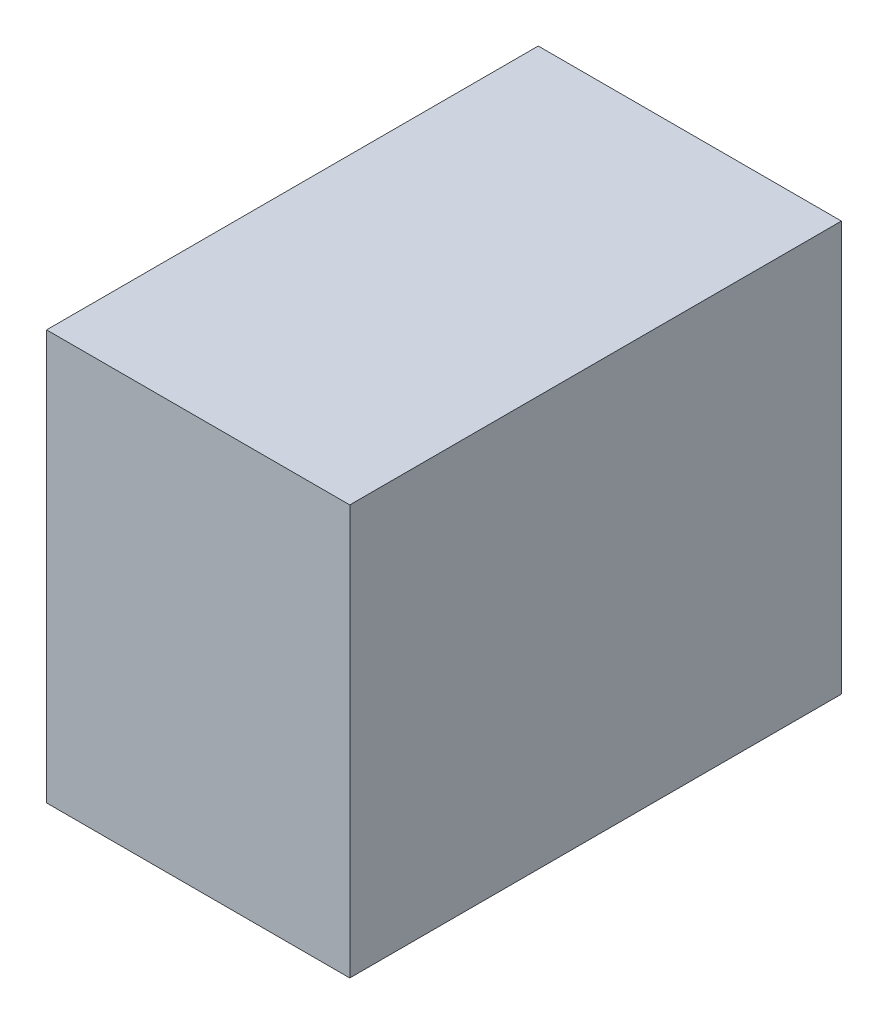
ISO-10303-21;
HEADER;
FILE_DESCRIPTION(('STEP AP214'),'2;1');
FILE_NAME('part.step','',(''),(''),'','','');
FILE_SCHEMA(('AUTOMOTIVE_DESIGN { 1 0 10303 214 1 1 1 1 }'));
ENDSEC;
DATA;
#1=APPLICATION_CONTEXT('core data for automotive mechanical design processes');
#2=APPLICATION_PROTOCOL_DEFINITION('international standard','automotive_design',2000,#1);
#3=PRODUCT_CONTEXT('',#1,'mechanical');
#4=PRODUCT('Part','Part','',(#3));
#5=PRODUCT_RELATED_PRODUCT_CATEGORY('part','',(#4));
#6=PRODUCT_DEFINITION_FORMATION('','',#4);
#7=PRODUCT_DEFINITION_CONTEXT('part definition',#1,'design');
#8=PRODUCT_DEFINITION('design','',#6,#7);
#9=PRODUCT_DEFINITION_SHAPE('','',#8);
#10=(LENGTH_UNIT() NAMED_UNIT(*) SI_UNIT(.MILLI.,.METRE.));
#11=(NAMED_UNIT(*) PLANE_ANGLE_UNIT() SI_UNIT($,.RADIAN.));
#12=(NAMED_UNIT(*) SI_UNIT($,.STERADIAN.) SOLID_ANGLE_UNIT());
#13=UNCERTAINTY_MEASURE_WITH_UNIT(LENGTH_MEASURE(1.E-05),#10,'distance_accuracy_value','');
#14=(GEOMETRIC_REPRESENTATION_CONTEXT(3) GLOBAL_UNCERTAINTY_ASSIGNED_CONTEXT((#13)) GLOBAL_UNIT_ASSIGNED_CONTEXT((#10,
#11,#12)) REPRESENTATION_CONTEXT('',''));
#15=CARTESIAN_POINT('',(0.,0.,0.));
#16=DIRECTION('',(0.,0.,1.));
#17=DIRECTION('',(1.,0.,0.));
#18=AXIS2_PLACEMENT_3D('',#15,#16,#17);
#19=CARTESIAN_POINT('',(469.9,635.,762.));
#20=DIRECTION('',(-1.,0.,0.));
#21=DIRECTION('',(0.,0.,1.));
#22=AXIS2_PLACEMENT_3D('',#19,#20,#21);
#23=PLANE('',#22);
#24=DIRECTION('',(0.,0.,-1.));
#25=VECTOR('',#24,1.);
#26=CARTESIAN_POINT('',(469.9,-635.,762.));
#27=LINE('',#26,#25);
#28=CARTESIAN_POINT('',(469.9,-635.,762.));
#29=VERTEX_POINT('',#28);
#30=CARTESIAN_POINT('',(469.9,-635.,-762.));
#31=VERTEX_POINT('',#30);
#32=EDGE_CURVE('E102',#29,#31,#27,.T.);
#33=ORIENTED_EDGE('',*,*,#32,.T.);
#34=DIRECTION('',(0.,-1.,0.));
#35=VECTOR('',#34,1.);
#36=CARTESIAN_POINT('',(469.9,635.,-762.));
#37=LINE('',#36,#35);
#38=CARTESIAN_POINT('',(469.9,635.,-762.));
#39=VERTEX_POINT('',#38);
#40=EDGE_CURVE('E11',#39,#31,#37,.T.);
#41=ORIENTED_EDGE('',*,*,#40,.F.);
#42=DIRECTION('',(0.,0.,-1.));
#43=VECTOR('',#42,1.);
#44=CARTESIAN_POINT('',(469.9,635.,762.));
#45=LINE('',#44,#43);
#46=CARTESIAN_POINT('',(469.9,635.,762.));
#47=VERTEX_POINT('',#46);
#48=EDGE_CURVE('E90',#47,#39,#45,.T.);
#49=ORIENTED_EDGE('',*,*,#48,.F.);
#50=DIRECTION('',(0.,-1.,0.));
#51=VECTOR('',#50,1.);
#52=CARTESIAN_POINT('',(469.9,635.,762.));
#53=LINE('',#52,#51);
#54=EDGE_CURVE('E98',#47,#29,#53,.T.);
#55=ORIENTED_EDGE('',*,*,#54,.T.);
#56=EDGE_LOOP('',(#33,#41,#49,#55));
#57=FACE_BOUND('',#56,.T.);
#58=ADVANCED_FACE('F39',(#57),#23,.F.);
#59=CARTESIAN_POINT('',(-469.9,635.,-762.));
#60=DIRECTION('',(0.,0.,1.));
#61=DIRECTION('',(1.,0.,0.));
#62=AXIS2_PLACEMENT_3D('',#59,#60,#61);
#63=PLANE('',#62);
#64=DIRECTION('',(-1.,0.,0.));
#65=VECTOR('',#64,1.);
#66=CARTESIAN_POINT('',(-469.9,-635.,-762.));
#67=LINE('',#66,#65);
#68=CARTESIAN_POINT('',(-469.9,-635.,-762.));
#69=VERTEX_POINT('',#68);
#70=EDGE_CURVE('E94',#31,#69,#67,.T.);
#71=ORIENTED_EDGE('',*,*,#70,.T.);
#72=DIRECTION('',(0.,-1.,0.));
#73=VECTOR('',#72,1.);
#74=CARTESIAN_POINT('',(-469.9,635.,-762.));
#75=LINE('',#74,#73);
#76=CARTESIAN_POINT('',(-469.9,635.,-762.));
#77=VERTEX_POINT('',#76);
#78=EDGE_CURVE('E47',#77,#69,#75,.T.);
#79=ORIENTED_EDGE('',*,*,#78,.F.);
#80=DIRECTION('',(-1.,0.,0.));
#81=VECTOR('',#80,1.);
#82=CARTESIAN_POINT('',(-469.9,635.,-762.));
#83=LINE('',#82,#81);
#84=EDGE_CURVE('E85',#39,#77,#83,.T.);
#85=ORIENTED_EDGE('',*,*,#84,.F.);
#86=ORIENTED_EDGE('',*,*,#40,.T.);
#87=EDGE_LOOP('',(#71,#79,#85,#86));
#88=FACE_BOUND('',#87,.T.);
#89=ADVANCED_FACE('F93',(#88),#63,.F.);
#90=CARTESIAN_POINT('',(-469.9,635.,762.));
#91=DIRECTION('',(1.,0.,0.));
#92=DIRECTION('',(0.,0.,-1.));
#93=AXIS2_PLACEMENT_3D('',#90,#91,#92);
#94=PLANE('',#93);
#95=DIRECTION('',(0.,0.,1.));
#96=VECTOR('',#95,1.);
#97=CARTESIAN_POINT('',(-469.9,-635.,762.));
#98=LINE('',#97,#96);
#99=CARTESIAN_POINT('',(-469.9,-635.,762.));
#100=VERTEX_POINT('',#99);
#101=EDGE_CURVE('E72',#69,#100,#98,.T.);
#102=ORIENTED_EDGE('',*,*,#101,.T.);
#103=DIRECTION('',(0.,-1.,0.));
#104=VECTOR('',#103,1.);
#105=CARTESIAN_POINT('',(-469.9,635.,762.));
#106=LINE('',#105,#104);
#107=CARTESIAN_POINT('',(-469.9,635.,762.));
#108=VERTEX_POINT('',#107);
#109=EDGE_CURVE('E95',#108,#100,#106,.T.);
#110=ORIENTED_EDGE('',*,*,#109,.F.);
#111=DIRECTION('',(0.,0.,1.));
#112=VECTOR('',#111,1.);
#113=CARTESIAN_POINT('',(-469.9,635.,762.));
#114=LINE('',#113,#112);
#115=EDGE_CURVE('E88',#77,#108,#114,.T.);
#116=ORIENTED_EDGE('',*,*,#115,.F.);
#117=ORIENTED_EDGE('',*,*,#78,.T.);
#118=EDGE_LOOP('',(#102,#110,#116,#117));
#119=FACE_BOUND('',#118,.T.);
#120=ADVANCED_FACE('F96',(#119),#94,.F.);
#121=CARTESIAN_POINT('',(-469.9,635.,762.));
#122=DIRECTION('',(0.,0.,-1.));
#123=DIRECTION('',(-1.,0.,0.));
#124=AXIS2_PLACEMENT_3D('',#121,#122,#123);
#125=PLANE('',#124);
#126=DIRECTION('',(1.,0.,0.));
#127=VECTOR('',#126,1.);
#128=CARTESIAN_POINT('',(-469.9,-635.,762.));
#129=LINE('',#128,#127);
#130=EDGE_CURVE('E78',#100,#29,#129,.T.);
#131=ORIENTED_EDGE('',*,*,#130,.T.);
#132=ORIENTED_EDGE('',*,*,#54,.F.);
#133=DIRECTION('',(1.,0.,0.));
#134=VECTOR('',#133,1.);
#135=CARTESIAN_POINT('',(-469.9,635.,762.));
#136=LINE('',#135,#134);
#137=EDGE_CURVE('E55',#108,#47,#136,.T.);
#138=ORIENTED_EDGE('',*,*,#137,.F.);
#139=ORIENTED_EDGE('',*,*,#109,.T.);
#140=EDGE_LOOP('',(#131,#132,#138,#139));
#141=FACE_BOUND('',#140,.T.);
#142=ADVANCED_FACE('F109',(#141),#125,.F.);
#143=CARTESIAN_POINT('',(0.,635.,0.));
#144=DIRECTION('',(0.,-1.,0.));
#145=DIRECTION('',(0.,0.,-1.));
#146=AXIS2_PLACEMENT_3D('',#143,#144,#145);
#147=PLANE('',#146);
#148=ORIENTED_EDGE('',*,*,#48,.T.);
#149=ORIENTED_EDGE('',*,*,#84,.T.);
#150=ORIENTED_EDGE('',*,*,#115,.T.);
#151=ORIENTED_EDGE('',*,*,#137,.T.);
#152=EDGE_LOOP('',(#148,#149,#150,#151));
#153=FACE_BOUND('',#152,.T.);
#154=ADVANCED_FACE('F86',(#153),#147,.F.);
#155=CARTESIAN_POINT('',(0.,-635.,0.));
#156=DIRECTION('',(0.,-1.,0.));
#157=DIRECTION('',(0.,0.,-1.));
#158=AXIS2_PLACEMENT_3D('',#155,#156,#157);
#159=PLANE('',#158);
#160=ORIENTED_EDGE('',*,*,#32,.F.);
#161=ORIENTED_EDGE('',*,*,#130,.F.);
#162=ORIENTED_EDGE('',*,*,#101,.F.);
#163=ORIENTED_EDGE('',*,*,#70,.F.);
#164=EDGE_LOOP('',(#160,#161,#162,#163));
#165=FACE_BOUND('',#164,.T.);
#166=ADVANCED_FACE('F112',(#165),#159,.T.);
#167=CLOSED_SHELL('',(#58,#89,#120,#142,#154,#166));
#168=MANIFOLD_SOLID_BREP('B2',#167);
#169=ADVANCED_BREP_SHAPE_REPRESENTATION('',(#18,#168),#14);
#170=SHAPE_DEFINITION_REPRESENTATION(#9,#169);
ENDSEC;
END-ISO-10303-21;
